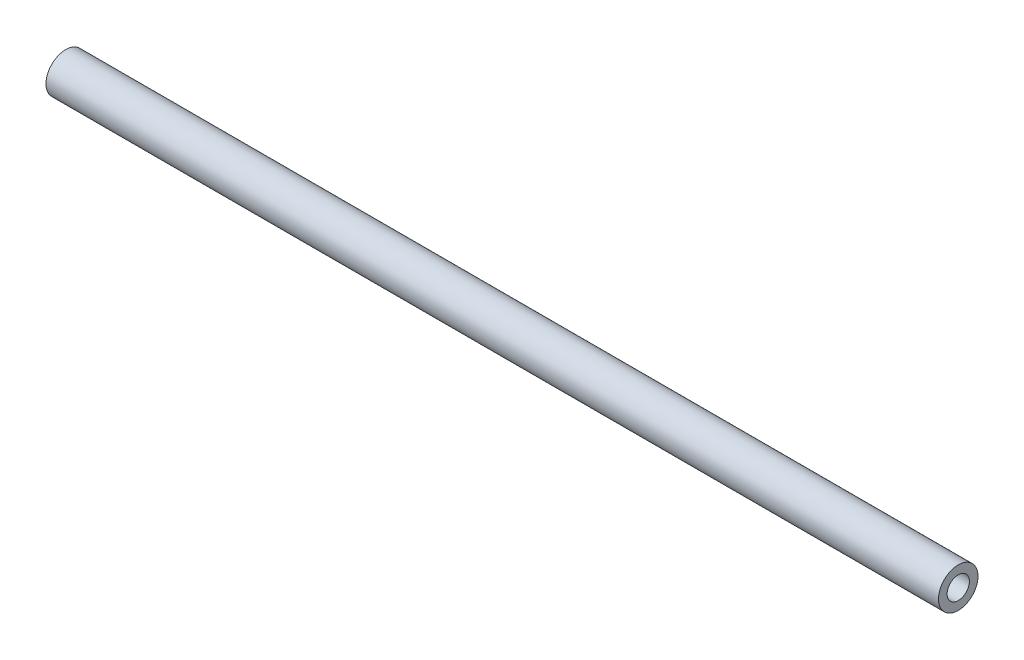
ISO-10303-21;
HEADER;
FILE_DESCRIPTION(('STEP AP214'),'2;1');
FILE_NAME('part.step','',(''),(''),'','','');
FILE_SCHEMA(('AUTOMOTIVE_DESIGN { 1 0 10303 214 1 1 1 1 }'));
ENDSEC;
DATA;
#1=APPLICATION_CONTEXT('core data for automotive mechanical design processes');
#2=APPLICATION_PROTOCOL_DEFINITION('international standard','automotive_design',2000,#1);
#3=PRODUCT_CONTEXT('',#1,'mechanical');
#4=PRODUCT('Part','Part','',(#3));
#5=PRODUCT_RELATED_PRODUCT_CATEGORY('part','',(#4));
#6=PRODUCT_DEFINITION_FORMATION('','',#4);
#7=PRODUCT_DEFINITION_CONTEXT('part definition',#1,'design');
#8=PRODUCT_DEFINITION('design','',#6,#7);
#9=PRODUCT_DEFINITION_SHAPE('','',#8);
#10=(LENGTH_UNIT() NAMED_UNIT(*) SI_UNIT(.MILLI.,.METRE.));
#11=(NAMED_UNIT(*) PLANE_ANGLE_UNIT() SI_UNIT($,.RADIAN.));
#12=(NAMED_UNIT(*) SI_UNIT($,.STERADIAN.) SOLID_ANGLE_UNIT());
#13=UNCERTAINTY_MEASURE_WITH_UNIT(LENGTH_MEASURE(1.E-05),#10,'distance_accuracy_value','');
#14=(GEOMETRIC_REPRESENTATION_CONTEXT(3) GLOBAL_UNCERTAINTY_ASSIGNED_CONTEXT((#13)) GLOBAL_UNIT_ASSIGNED_CONTEXT((#10,
#11,#12)) REPRESENTATION_CONTEXT('',''));
#15=CARTESIAN_POINT('',(0.,0.,0.));
#16=DIRECTION('',(0.,0.,1.));
#17=DIRECTION('',(1.,0.,0.));
#18=AXIS2_PLACEMENT_3D('',#15,#16,#17);
#19=CARTESIAN_POINT('',(-35.,0.,0.));
#20=DIRECTION('',(1.,0.,0.));
#21=DIRECTION('',(0.,0.,-1.));
#22=AXIS2_PLACEMENT_3D('',#19,#20,#21);
#23=CYLINDRICAL_SURFACE('',#22,1.55);
#24=CARTESIAN_POINT('',(-35.,0.,0.));
#25=DIRECTION('',(1.,0.,0.));
#26=DIRECTION('',(0.,0.,-1.));
#27=AXIS2_PLACEMENT_3D('',#24,#25,#26);
#28=CIRCLE('',#27,1.55);
#29=CARTESIAN_POINT('',(-35.,0.,-1.55));
#30=VERTEX_POINT('',#29);
#31=EDGE_CURVE('E11',#30,#30,#28,.T.);
#32=ORIENTED_EDGE('',*,*,#31,.T.);
#33=EDGE_LOOP('',(#32));
#34=FACE_BOUND('',#33,.T.);
#35=CARTESIAN_POINT('',(35.,0.,0.));
#36=DIRECTION('',(1.,0.,0.));
#37=DIRECTION('',(0.,0.,-1.));
#38=AXIS2_PLACEMENT_3D('',#35,#36,#37);
#39=CIRCLE('',#38,1.55);
#40=CARTESIAN_POINT('',(35.,0.,-1.55));
#41=VERTEX_POINT('',#40);
#42=EDGE_CURVE('E51',#41,#41,#39,.T.);
#43=ORIENTED_EDGE('',*,*,#42,.F.);
#44=EDGE_LOOP('',(#43));
#45=FACE_BOUND('',#44,.T.);
#46=ADVANCED_FACE('F43',(#34,#45),#23,.T.);
#47=CARTESIAN_POINT('',(-35.,0.,0.));
#48=DIRECTION('',(1.,0.,0.));
#49=DIRECTION('',(0.,0.,-1.));
#50=AXIS2_PLACEMENT_3D('',#47,#48,#49);
#51=PLANE('',#50);
#52=CARTESIAN_POINT('',(-35.,0.,0.));
#53=DIRECTION('',(-1.,0.,0.));
#54=DIRECTION('',(0.,0.,1.));
#55=AXIS2_PLACEMENT_3D('',#52,#53,#54);
#56=CIRCLE('',#55,0.874999999999989);
#57=CARTESIAN_POINT('',(-35.,0.,0.874999999999989));
#58=VERTEX_POINT('',#57);
#59=EDGE_CURVE('E69',#58,#58,#56,.T.);
#60=ORIENTED_EDGE('',*,*,#59,.F.);
#61=EDGE_LOOP('',(#60));
#62=FACE_BOUND('',#61,.T.);
#63=ORIENTED_EDGE('',*,*,#31,.F.);
#64=EDGE_LOOP('',(#63));
#65=FACE_BOUND('',#64,.T.);
#66=ADVANCED_FACE('F88',(#62,#65),#51,.F.);
#67=CARTESIAN_POINT('',(35.,0.,0.));
#68=DIRECTION('',(1.,0.,0.));
#69=DIRECTION('',(0.,0.,-1.));
#70=AXIS2_PLACEMENT_3D('',#67,#68,#69);
#71=PLANE('',#70);
#72=CARTESIAN_POINT('',(35.,0.,0.));
#73=DIRECTION('',(1.,0.,0.));
#74=DIRECTION('',(0.,0.,-1.));
#75=AXIS2_PLACEMENT_3D('',#72,#73,#74);
#76=CIRCLE('',#75,0.874999999999989);
#77=CARTESIAN_POINT('',(35.,0.,-0.874999999999989));
#78=VERTEX_POINT('',#77);
#79=EDGE_CURVE('E68',#78,#78,#76,.T.);
#80=ORIENTED_EDGE('',*,*,#79,.F.);
#81=EDGE_LOOP('',(#80));
#82=FACE_BOUND('',#81,.T.);
#83=ORIENTED_EDGE('',*,*,#42,.T.);
#84=EDGE_LOOP('',(#83));
#85=FACE_BOUND('',#84,.T.);
#86=ADVANCED_FACE('F85',(#82,#85),#71,.T.);
#87=CARTESIAN_POINT('',(25.,0.,0.));
#88=DIRECTION('',(1.,0.,0.));
#89=DIRECTION('',(0.,0.,-1.));
#90=AXIS2_PLACEMENT_3D('',#87,#88,#89);
#91=CONICAL_SURFACE('',#90,0.87499999999999,1.02974425867665);
#92=CARTESIAN_POINT('',(24.4742469583509,0.,0.));
#93=VERTEX_POINT('',#92);
#94=VERTEX_LOOP('',#93);
#95=FACE_BOUND('',#94,.T.);
#96=CARTESIAN_POINT('',(25.,0.,0.));
#97=DIRECTION('',(1.,0.,0.));
#98=DIRECTION('',(0.,0.,-1.));
#99=AXIS2_PLACEMENT_3D('',#96,#97,#98);
#100=CIRCLE('',#99,0.87499999999999);
#101=CARTESIAN_POINT('',(25.,0.,-0.87499999999999));
#102=VERTEX_POINT('',#101);
#103=EDGE_CURVE('E74',#102,#102,#100,.T.);
#104=ORIENTED_EDGE('',*,*,#103,.T.);
#105=EDGE_LOOP('',(#104));
#106=FACE_BOUND('',#105,.T.);
#107=ADVANCED_FACE('F99',(#95,#106),#91,.F.);
#108=CARTESIAN_POINT('',(35.,0.,0.));
#109=DIRECTION('',(1.,0.,0.));
#110=DIRECTION('',(0.,0.,-1.));
#111=AXIS2_PLACEMENT_3D('',#108,#109,#110);
#112=CYLINDRICAL_SURFACE('',#111,0.874999999999989);
#113=ORIENTED_EDGE('',*,*,#103,.F.);
#114=EDGE_LOOP('',(#113));
#115=FACE_BOUND('',#114,.T.);
#116=ORIENTED_EDGE('',*,*,#79,.T.);
#117=EDGE_LOOP('',(#116));
#118=FACE_BOUND('',#117,.T.);
#119=ADVANCED_FACE('F61',(#115,#118),#112,.F.);
#120=CARTESIAN_POINT('',(-25.,0.,0.));
#121=DIRECTION('',(-1.,0.,0.));
#122=DIRECTION('',(0.,0.,1.));
#123=AXIS2_PLACEMENT_3D('',#120,#121,#122);
#124=CONICAL_SURFACE('',#123,0.87499999999999,1.02974425867665);
#125=CARTESIAN_POINT('',(-24.4742469583509,0.,0.));
#126=VERTEX_POINT('',#125);
#127=VERTEX_LOOP('',#126);
#128=FACE_BOUND('',#127,.T.);
#129=CARTESIAN_POINT('',(-25.,0.,0.));
#130=DIRECTION('',(-1.,0.,0.));
#131=DIRECTION('',(0.,0.,1.));
#132=AXIS2_PLACEMENT_3D('',#129,#130,#131);
#133=CIRCLE('',#132,0.87499999999999);
#134=CARTESIAN_POINT('',(-25.,0.,0.87499999999999));
#135=VERTEX_POINT('',#134);
#136=EDGE_CURVE('E65',#135,#135,#133,.T.);
#137=ORIENTED_EDGE('',*,*,#136,.T.);
#138=EDGE_LOOP('',(#137));
#139=FACE_BOUND('',#138,.T.);
#140=ADVANCED_FACE('F57',(#128,#139),#124,.F.);
#141=CARTESIAN_POINT('',(-35.,0.,0.));
#142=DIRECTION('',(-1.,0.,0.));
#143=DIRECTION('',(0.,0.,1.));
#144=AXIS2_PLACEMENT_3D('',#141,#142,#143);
#145=CYLINDRICAL_SURFACE('',#144,0.874999999999989);
#146=ORIENTED_EDGE('',*,*,#136,.F.);
#147=EDGE_LOOP('',(#146));
#148=FACE_BOUND('',#147,.T.);
#149=ORIENTED_EDGE('',*,*,#59,.T.);
#150=EDGE_LOOP('',(#149));
#151=FACE_BOUND('',#150,.T.);
#152=ADVANCED_FACE('F60',(#148,#151),#145,.F.);
#153=CLOSED_SHELL('',(#46,#66,#86,#107,#119,#140,#152));
#154=MANIFOLD_SOLID_BREP('B2',#153);
#155=ADVANCED_BREP_SHAPE_REPRESENTATION('',(#18,#154),#14);
#156=SHAPE_DEFINITION_REPRESENTATION(#9,#155);
ENDSEC;
END-ISO-10303-21;
